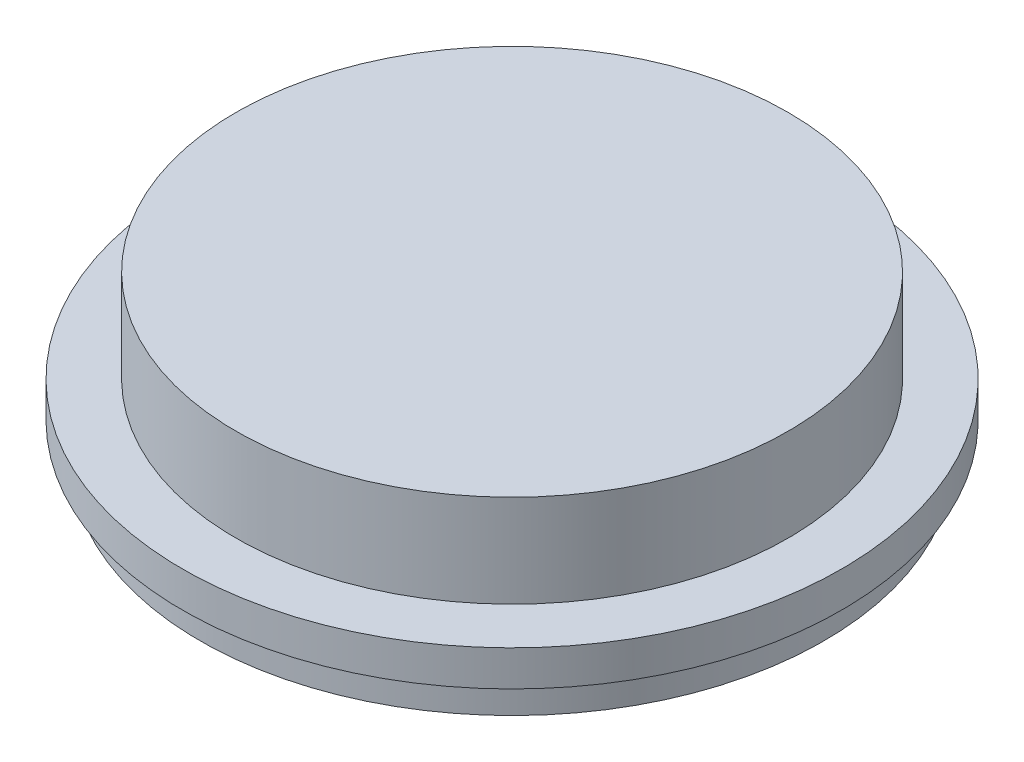
ISO-10303-21;
HEADER;
FILE_DESCRIPTION(('STEP AP214'),'2;1');
FILE_NAME('part.step','',(''),(''),'','','');
FILE_SCHEMA(('AUTOMOTIVE_DESIGN { 1 0 10303 214 1 1 1 1 }'));
ENDSEC;
DATA;
#1=APPLICATION_CONTEXT('core data for automotive mechanical design processes');
#2=APPLICATION_PROTOCOL_DEFINITION('international standard','automotive_design',2000,#1);
#3=PRODUCT_CONTEXT('',#1,'mechanical');
#4=PRODUCT('Part','Part','',(#3));
#5=PRODUCT_RELATED_PRODUCT_CATEGORY('part','',(#4));
#6=PRODUCT_DEFINITION_FORMATION('','',#4);
#7=PRODUCT_DEFINITION_CONTEXT('part definition',#1,'design');
#8=PRODUCT_DEFINITION('design','',#6,#7);
#9=PRODUCT_DEFINITION_SHAPE('','',#8);
#10=(LENGTH_UNIT() NAMED_UNIT(*) SI_UNIT(.MILLI.,.METRE.));
#11=(NAMED_UNIT(*) PLANE_ANGLE_UNIT() SI_UNIT($,.RADIAN.));
#12=(NAMED_UNIT(*) SI_UNIT($,.STERADIAN.) SOLID_ANGLE_UNIT());
#13=UNCERTAINTY_MEASURE_WITH_UNIT(LENGTH_MEASURE(1.E-05),#10,'distance_accuracy_value','');
#14=(GEOMETRIC_REPRESENTATION_CONTEXT(3) GLOBAL_UNCERTAINTY_ASSIGNED_CONTEXT((#13)) GLOBAL_UNIT_ASSIGNED_CONTEXT((#10,
#11,#12)) REPRESENTATION_CONTEXT('',''));
#15=CARTESIAN_POINT('',(0.,0.,0.));
#16=DIRECTION('',(0.,0.,1.));
#17=DIRECTION('',(1.,0.,0.));
#18=AXIS2_PLACEMENT_3D('',#15,#16,#17);
#19=CARTESIAN_POINT('',(0.,0.,0.));
#20=DIRECTION('',(0.,1.,0.));
#21=DIRECTION('',(0.,0.,1.));
#22=AXIS2_PLACEMENT_3D('',#19,#20,#21);
#23=PLANE('',#22);
#24=CARTESIAN_POINT('',(0.,0.,0.));
#25=DIRECTION('',(0.,-1.,0.));
#26=DIRECTION('',(0.,0.,-1.));
#27=AXIS2_PLACEMENT_3D('',#24,#25,#26);
#28=CIRCLE('',#27,49.2125);
#29=CARTESIAN_POINT('',(0.,0.,-49.2125));
#30=VERTEX_POINT('',#29);
#31=EDGE_CURVE('E10',#30,#30,#28,.T.);
#32=ORIENTED_EDGE('',*,*,#31,.F.);
#33=EDGE_LOOP('',(#32));
#34=FACE_BOUND('',#33,.T.);
#35=ADVANCED_FACE('F32',(#34),#23,.T.);
#36=CARTESIAN_POINT('',(0.,0.,0.));
#37=DIRECTION('',(0.,-1.,0.));
#38=DIRECTION('',(0.,0.,-1.));
#39=AXIS2_PLACEMENT_3D('',#36,#37,#38);
#40=CYLINDRICAL_SURFACE('',#39,49.2125);
#41=ORIENTED_EDGE('',*,*,#31,.T.);
#42=EDGE_LOOP('',(#41));
#43=FACE_BOUND('',#42,.T.);
#44=CARTESIAN_POINT('',(0.,-16.51,0.));
#45=DIRECTION('',(0.,-1.,0.));
#46=DIRECTION('',(0.,0.,-1.));
#47=AXIS2_PLACEMENT_3D('',#44,#45,#46);
#48=CIRCLE('',#47,49.2125);
#49=CARTESIAN_POINT('',(0.,-16.51,-49.2125));
#50=VERTEX_POINT('',#49);
#51=EDGE_CURVE('E38',#50,#50,#48,.T.);
#52=ORIENTED_EDGE('',*,*,#51,.F.);
#53=EDGE_LOOP('',(#52));
#54=FACE_BOUND('',#53,.T.);
#55=ADVANCED_FACE('F86',(#43,#54),#40,.T.);
#56=CARTESIAN_POINT('',(49.2125,-16.51,0.));
#57=DIRECTION('',(0.,1.,0.));
#58=DIRECTION('',(0.,0.,1.));
#59=AXIS2_PLACEMENT_3D('',#56,#57,#58);
#60=PLANE('',#59);
#61=ORIENTED_EDGE('',*,*,#51,.T.);
#62=EDGE_LOOP('',(#61));
#63=FACE_BOUND('',#62,.T.);
#64=CARTESIAN_POINT('',(0.,-16.51,0.));
#65=DIRECTION('',(0.,-1.,0.));
#66=DIRECTION('',(0.,0.,-1.));
#67=AXIS2_PLACEMENT_3D('',#64,#65,#66);
#68=CIRCLE('',#67,58.7375);
#69=CARTESIAN_POINT('',(0.,-16.51,-58.7375));
#70=VERTEX_POINT('',#69);
#71=EDGE_CURVE('E42',#70,#70,#68,.T.);
#72=ORIENTED_EDGE('',*,*,#71,.F.);
#73=EDGE_LOOP('',(#72));
#74=FACE_BOUND('',#73,.T.);
#75=ADVANCED_FACE('F91',(#63,#74),#60,.T.);
#76=CARTESIAN_POINT('',(0.,0.,0.));
#77=DIRECTION('',(0.,-1.,0.));
#78=DIRECTION('',(0.,0.,-1.));
#79=AXIS2_PLACEMENT_3D('',#76,#77,#78);
#80=CYLINDRICAL_SURFACE('',#79,58.7375);
#81=ORIENTED_EDGE('',*,*,#71,.T.);
#82=EDGE_LOOP('',(#81));
#83=FACE_BOUND('',#82,.T.);
#84=CARTESIAN_POINT('',(0.,-22.86,0.));
#85=DIRECTION('',(0.,-1.,0.));
#86=DIRECTION('',(0.,0.,-1.));
#87=AXIS2_PLACEMENT_3D('',#84,#85,#86);
#88=CIRCLE('',#87,58.7375);
#89=CARTESIAN_POINT('',(0.,-22.86,-58.7375));
#90=VERTEX_POINT('',#89);
#91=EDGE_CURVE('E46',#90,#90,#88,.T.);
#92=ORIENTED_EDGE('',*,*,#91,.F.);
#93=EDGE_LOOP('',(#92));
#94=FACE_BOUND('',#93,.T.);
#95=ADVANCED_FACE('F95',(#83,#94),#80,.T.);
#96=CARTESIAN_POINT('',(58.7375,-22.86,0.));
#97=DIRECTION('',(0.,-1.,0.));
#98=DIRECTION('',(0.,0.,-1.));
#99=AXIS2_PLACEMENT_3D('',#96,#97,#98);
#100=PLANE('',#99);
#101=ORIENTED_EDGE('',*,*,#91,.T.);
#102=EDGE_LOOP('',(#101));
#103=FACE_BOUND('',#102,.T.);
#104=CARTESIAN_POINT('',(0.,-22.86,0.));
#105=DIRECTION('',(0.,-1.,0.));
#106=DIRECTION('',(0.,0.,-1.));
#107=AXIS2_PLACEMENT_3D('',#104,#105,#106);
#108=CIRCLE('',#107,55.5625);
#109=CARTESIAN_POINT('',(0.,-22.86,-55.5625));
#110=VERTEX_POINT('',#109);
#111=EDGE_CURVE('E51',#110,#110,#108,.T.);
#112=ORIENTED_EDGE('',*,*,#111,.F.);
#113=EDGE_LOOP('',(#112));
#114=FACE_BOUND('',#113,.T.);
#115=ADVANCED_FACE('F101',(#103,#114),#100,.T.);
#116=CARTESIAN_POINT('',(0.,0.,0.));
#117=DIRECTION('',(0.,-1.,0.));
#118=DIRECTION('',(0.,0.,-1.));
#119=AXIS2_PLACEMENT_3D('',#116,#117,#118);
#120=CYLINDRICAL_SURFACE('',#119,55.5625);
#121=ORIENTED_EDGE('',*,*,#111,.T.);
#122=EDGE_LOOP('',(#121));
#123=FACE_BOUND('',#122,.T.);
#124=CARTESIAN_POINT('',(0.,-29.21,0.));
#125=DIRECTION('',(0.,-1.,0.));
#126=DIRECTION('',(0.,0.,-1.));
#127=AXIS2_PLACEMENT_3D('',#124,#125,#126);
#128=CIRCLE('',#127,55.5625);
#129=CARTESIAN_POINT('',(0.,-29.21,-55.5625));
#130=VERTEX_POINT('',#129);
#131=EDGE_CURVE('E54',#130,#130,#128,.T.);
#132=ORIENTED_EDGE('',*,*,#131,.F.);
#133=EDGE_LOOP('',(#132));
#134=FACE_BOUND('',#133,.T.);
#135=ADVANCED_FACE('F105',(#123,#134),#120,.T.);
#136=CARTESIAN_POINT('',(55.5625,-29.21,0.));
#137=DIRECTION('',(0.,-1.,0.));
#138=DIRECTION('',(0.,0.,-1.));
#139=AXIS2_PLACEMENT_3D('',#136,#137,#138);
#140=PLANE('',#139);
#141=ORIENTED_EDGE('',*,*,#131,.T.);
#142=EDGE_LOOP('',(#141));
#143=FACE_BOUND('',#142,.T.);
#144=CARTESIAN_POINT('',(0.,-29.21,0.));
#145=DIRECTION('',(0.,-1.,0.));
#146=DIRECTION('',(0.,0.,-1.));
#147=AXIS2_PLACEMENT_3D('',#144,#145,#146);
#148=CIRCLE('',#147,49.2125);
#149=CARTESIAN_POINT('',(0.,-29.21,-49.2125));
#150=VERTEX_POINT('',#149);
#151=EDGE_CURVE('E57',#150,#150,#148,.T.);
#152=ORIENTED_EDGE('',*,*,#151,.F.);
#153=EDGE_LOOP('',(#152));
#154=FACE_BOUND('',#153,.T.);
#155=ADVANCED_FACE('F109',(#143,#154),#140,.T.);
#156=CARTESIAN_POINT('',(0.,0.,0.));
#157=DIRECTION('',(0.,-1.,0.));
#158=DIRECTION('',(0.,0.,-1.));
#159=AXIS2_PLACEMENT_3D('',#156,#157,#158);
#160=CYLINDRICAL_SURFACE('',#159,49.2125);
#161=ORIENTED_EDGE('',*,*,#151,.T.);
#162=EDGE_LOOP('',(#161));
#163=FACE_BOUND('',#162,.T.);
#164=CARTESIAN_POINT('',(0.,-22.86,0.));
#165=DIRECTION('',(0.,-1.,0.));
#166=DIRECTION('',(0.,0.,-1.));
#167=AXIS2_PLACEMENT_3D('',#164,#165,#166);
#168=CIRCLE('',#167,49.2125);
#169=CARTESIAN_POINT('',(0.,-22.86,-49.2125));
#170=VERTEX_POINT('',#169);
#171=EDGE_CURVE('E60',#170,#170,#168,.T.);
#172=ORIENTED_EDGE('',*,*,#171,.F.);
#173=EDGE_LOOP('',(#172));
#174=FACE_BOUND('',#173,.T.);
#175=ADVANCED_FACE('F82',(#163,#174),#160,.F.);
#176=CARTESIAN_POINT('',(49.2125,-22.86,0.));
#177=DIRECTION('',(0.,-1.,0.));
#178=DIRECTION('',(0.,0.,-1.));
#179=AXIS2_PLACEMENT_3D('',#176,#177,#178);
#180=PLANE('',#179);
#181=ORIENTED_EDGE('',*,*,#171,.T.);
#182=EDGE_LOOP('',(#181));
#183=FACE_BOUND('',#182,.T.);
#184=CARTESIAN_POINT('',(0.,-22.86,0.));
#185=DIRECTION('',(0.,-1.,0.));
#186=DIRECTION('',(0.,0.,-1.));
#187=AXIS2_PLACEMENT_3D('',#184,#185,#186);
#188=CIRCLE('',#187,42.8625);
#189=CARTESIAN_POINT('',(0.,-22.86,-42.8625));
#190=VERTEX_POINT('',#189);
#191=EDGE_CURVE('E63',#190,#190,#188,.T.);
#192=ORIENTED_EDGE('',*,*,#191,.F.);
#193=EDGE_LOOP('',(#192));
#194=FACE_BOUND('',#193,.T.);
#195=ADVANCED_FACE('F74',(#183,#194),#180,.T.);
#196=CARTESIAN_POINT('',(0.,0.,0.));
#197=DIRECTION('',(0.,-1.,0.));
#198=DIRECTION('',(0.,0.,-1.));
#199=AXIS2_PLACEMENT_3D('',#196,#197,#198);
#200=CYLINDRICAL_SURFACE('',#199,42.8625);
#201=ORIENTED_EDGE('',*,*,#191,.T.);
#202=EDGE_LOOP('',(#201));
#203=FACE_BOUND('',#202,.T.);
#204=CARTESIAN_POINT('',(0.,-6.35,0.));
#205=DIRECTION('',(0.,-1.,0.));
#206=DIRECTION('',(0.,0.,-1.));
#207=AXIS2_PLACEMENT_3D('',#204,#205,#206);
#208=CIRCLE('',#207,42.8625);
#209=CARTESIAN_POINT('',(0.,-6.35,-42.8625));
#210=VERTEX_POINT('',#209);
#211=EDGE_CURVE('E66',#210,#210,#208,.T.);
#212=ORIENTED_EDGE('',*,*,#211,.F.);
#213=EDGE_LOOP('',(#212));
#214=FACE_BOUND('',#213,.T.);
#215=ADVANCED_FACE('F72',(#203,#214),#200,.F.);
#216=CARTESIAN_POINT('',(42.8625,-6.35,0.));
#217=DIRECTION('',(0.,-1.,0.));
#218=DIRECTION('',(0.,0.,-1.));
#219=AXIS2_PLACEMENT_3D('',#216,#217,#218);
#220=PLANE('',#219);
#221=ORIENTED_EDGE('',*,*,#211,.T.);
#222=EDGE_LOOP('',(#221));
#223=FACE_BOUND('',#222,.T.);
#224=ADVANCED_FACE('F70',(#223),#220,.T.);
#225=CLOSED_SHELL('',(#35,#55,#75,#95,#115,#135,#155,#175,#195,#215,#224));
#226=MANIFOLD_SOLID_BREP('B2',#225);
#227=ADVANCED_BREP_SHAPE_REPRESENTATION('',(#18,#226),#14);
#228=SHAPE_DEFINITION_REPRESENTATION(#9,#227);
ENDSEC;
END-ISO-10303-21;
